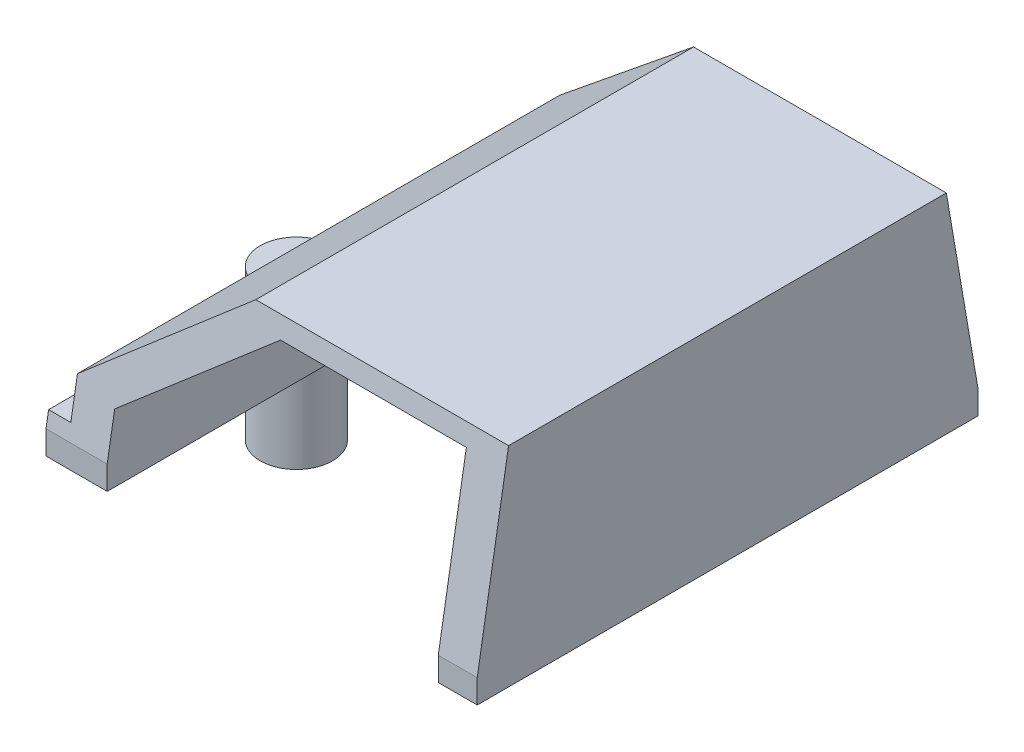
ISO-10303-21;
HEADER;
FILE_DESCRIPTION(('STEP AP214'),'2;1');
FILE_NAME('part.step','',(''),(''),'','','');
FILE_SCHEMA(('AUTOMOTIVE_DESIGN { 1 0 10303 214 1 1 1 1 }'));
ENDSEC;
DATA;
#1=APPLICATION_CONTEXT('core data for automotive mechanical design processes');
#2=APPLICATION_PROTOCOL_DEFINITION('international standard','automotive_design',2000,#1);
#3=PRODUCT_CONTEXT('',#1,'mechanical');
#4=PRODUCT('Part','Part','',(#3));
#5=PRODUCT_RELATED_PRODUCT_CATEGORY('part','',(#4));
#6=PRODUCT_DEFINITION_FORMATION('','',#4);
#7=PRODUCT_DEFINITION_CONTEXT('part definition',#1,'design');
#8=PRODUCT_DEFINITION('design','',#6,#7);
#9=PRODUCT_DEFINITION_SHAPE('','',#8);
#10=(LENGTH_UNIT() NAMED_UNIT(*) SI_UNIT(.MILLI.,.METRE.));
#11=(NAMED_UNIT(*) PLANE_ANGLE_UNIT() SI_UNIT($,.RADIAN.));
#12=(NAMED_UNIT(*) SI_UNIT($,.STERADIAN.) SOLID_ANGLE_UNIT());
#13=UNCERTAINTY_MEASURE_WITH_UNIT(LENGTH_MEASURE(1.E-05),#10,'distance_accuracy_value','');
#14=(GEOMETRIC_REPRESENTATION_CONTEXT(3) GLOBAL_UNCERTAINTY_ASSIGNED_CONTEXT((#13)) GLOBAL_UNIT_ASSIGNED_CONTEXT((#10,
#11,#12)) REPRESENTATION_CONTEXT('',''));
#15=CARTESIAN_POINT('',(0.,0.,0.));
#16=DIRECTION('',(0.,0.,1.));
#17=DIRECTION('',(1.,0.,0.));
#18=AXIS2_PLACEMENT_3D('',#15,#16,#17);
#19=CARTESIAN_POINT('',(-13.789144220563,-5.08,19.8204372004348));
#20=DIRECTION('',(0.,1.,0.));
#21=DIRECTION('',(0.,0.,1.));
#22=AXIS2_PLACEMENT_3D('',#19,#20,#21);
#23=CYLINDRICAL_SURFACE('',#22,1.651);
#24=CARTESIAN_POINT('',(-13.789144220563,-5.08,19.8204372004348));
#25=DIRECTION('',(0.,1.,0.));
#26=DIRECTION('',(0.,0.,1.));
#27=AXIS2_PLACEMENT_3D('',#24,#25,#26);
#28=CIRCLE('',#27,1.651);
#29=CARTESIAN_POINT('',(-13.789144220563,-5.08,21.4714372004348));
#30=VERTEX_POINT('',#29);
#31=EDGE_CURVE('E12',#30,#30,#28,.T.);
#32=ORIENTED_EDGE('',*,*,#31,.T.);
#33=EDGE_LOOP('',(#32));
#34=FACE_BOUND('',#33,.T.);
#35=CARTESIAN_POINT('',(-13.789144220563,0.,19.8204372004348));
#36=DIRECTION('',(0.,1.,0.));
#37=DIRECTION('',(0.,0.,1.));
#38=AXIS2_PLACEMENT_3D('',#35,#36,#37);
#39=CIRCLE('',#38,1.651);
#40=CARTESIAN_POINT('',(-13.789144220563,0.,21.4714372004348));
#41=VERTEX_POINT('',#40);
#42=EDGE_CURVE('E71',#41,#41,#39,.T.);
#43=ORIENTED_EDGE('',*,*,#42,.F.);
#44=EDGE_LOOP('',(#43));
#45=FACE_BOUND('',#44,.T.);
#46=ADVANCED_FACE('F68',(#34,#45),#23,.T.);
#47=CARTESIAN_POINT('',(-13.789144220563,-5.08,19.8204372004348));
#48=DIRECTION('',(0.,1.,0.));
#49=DIRECTION('',(0.,0.,1.));
#50=AXIS2_PLACEMENT_3D('',#47,#48,#49);
#51=PLANE('',#50);
#52=ORIENTED_EDGE('',*,*,#31,.F.);
#53=EDGE_LOOP('',(#52));
#54=FACE_BOUND('',#53,.T.);
#55=ADVANCED_FACE('F87',(#54),#51,.F.);
#56=CARTESIAN_POINT('',(-13.789144220563,0.,19.8204372004348));
#57=DIRECTION('',(0.,1.,0.));
#58=DIRECTION('',(0.,0.,1.));
#59=AXIS2_PLACEMENT_3D('',#56,#57,#58);
#60=PLANE('',#59);
#61=ORIENTED_EDGE('',*,*,#42,.T.);
#62=EDGE_LOOP('',(#61));
#63=FACE_BOUND('',#62,.T.);
#64=ADVANCED_FACE('F84',(#63),#60,.T.);
#65=CLOSED_SHELL('',(#46,#55,#64));
#66=MANIFOLD_SOLID_BREP('B2',#65);
#67=CARTESIAN_POINT('',(-15.440144220563,-1.36242874976471,7.97278696369274));
#68=DIRECTION('',(0.,0.168443169401586,-0.985711366821925));
#69=DIRECTION('',(0.,0.985711366821926,0.168443169401586));
#70=AXIS2_PLACEMENT_3D('',#67,#68,#69);
#71=PLANE('',#70);
#72=DIRECTION('',(0.,0.985711366821926,0.168443169401586));
#73=VECTOR('',#72,1.);
#74=CARTESIAN_POINT('',(4.11785577943697,-1.36242874976471,7.97278696369274));
#75=LINE('',#74,#73);
#76=CARTESIAN_POINT('',(4.11785577943697,1.08161565509339,8.39043720043479));
#77=VERTEX_POINT('',#76);
#78=CARTESIAN_POINT('',(4.11785577943696,8.65618487830787,9.6848165590939));
#79=VERTEX_POINT('',#78);
#80=EDGE_CURVE('E258',#77,#79,#75,.T.);
#81=ORIENTED_EDGE('',*,*,#80,.T.);
#82=DIRECTION('',(1.,0.,0.));
#83=VECTOR('',#82,1.);
#84=CARTESIAN_POINT('',(-15.440144220563,8.65618487830787,9.6848165590939));
#85=LINE('',#84,#83);
#86=CARTESIAN_POINT('',(-4.36387843382127,8.65618487830787,9.6848165590939));
#87=VERTEX_POINT('',#86);
#88=EDGE_CURVE('E265',#87,#79,#85,.T.);
#89=ORIENTED_EDGE('',*,*,#88,.F.);
#90=DIRECTION('',(-0.761411365987416,-0.639006148959604,-0.109196489581826));
#91=VECTOR('',#90,1.);
#92=CARTESIAN_POINT('',(-15.8021791542523,-0.943283714501808,8.04441251307263));
#93=LINE('',#92,#91);
#94=CARTESIAN_POINT('',(-10.995144220563,3.09096770083869,8.73380508521444));
#95=VERTEX_POINT('',#94);
#96=EDGE_CURVE('E248',#87,#95,#93,.T.);
#97=ORIENTED_EDGE('',*,*,#96,.T.);
#98=DIRECTION('',(0.,-0.985711366821926,-0.168443169401586));
#99=VECTOR('',#98,1.);
#100=CARTESIAN_POINT('',(-10.995144220563,-1.36242874976471,7.97278696369274));
#101=LINE('',#100,#99);
#102=CARTESIAN_POINT('',(-10.995144220563,1.08161565509339,8.39043720043479));
#103=VERTEX_POINT('',#102);
#104=EDGE_CURVE('E296',#95,#103,#101,.T.);
#105=ORIENTED_EDGE('',*,*,#104,.T.);
#106=DIRECTION('',(1.,0.,0.));
#107=VECTOR('',#106,1.);
#108=CARTESIAN_POINT('',(-15.440144220563,1.08161565509339,8.39043720043479));
#109=LINE('',#108,#107);
#110=CARTESIAN_POINT('',(-13.789144220563,1.08161565509339,8.39043720043479));
#111=VERTEX_POINT('',#110);
#112=EDGE_CURVE('E344',#111,#103,#109,.T.);
#113=ORIENTED_EDGE('',*,*,#112,.F.);
#114=DIRECTION('',(0.,0.985711366821926,0.168443169401586));
#115=VECTOR('',#114,1.);
#116=CARTESIAN_POINT('',(-13.789144220563,9.29873875908244,9.79461930240396));
#117=LINE('',#116,#115);
#118=CARTESIAN_POINT('',(-13.789144220563,1.778,8.50943875619032));
#119=VERTEX_POINT('',#118);
#120=EDGE_CURVE('E354',#111,#119,#117,.T.);
#121=ORIENTED_EDGE('',*,*,#120,.T.);
#122=DIRECTION('',(1.,0.,0.));
#123=VECTOR('',#122,1.);
#124=CARTESIAN_POINT('',(-12.773144220563,1.778,8.50943875619032));
#125=LINE('',#124,#123);
#126=CARTESIAN_POINT('',(-12.773144220563,1.778,8.50943875619032));
#127=VERTEX_POINT('',#126);
#128=EDGE_CURVE('E351',#119,#127,#125,.T.);
#129=ORIENTED_EDGE('',*,*,#128,.T.);
#130=DIRECTION('',(0.,0.985711366821926,0.168443169401586));
#131=VECTOR('',#130,1.);
#132=CARTESIAN_POINT('',(-12.773144220563,3.48579404228216,8.80127493750031));
#133=LINE('',#132,#131);
#134=CARTESIAN_POINT('',(-12.773144220563,3.556,8.81327207421487));
#135=VERTEX_POINT('',#134);
#136=EDGE_CURVE('E335',#127,#135,#133,.T.);
#137=ORIENTED_EDGE('',*,*,#136,.T.);
#138=DIRECTION('',(0.761411365987416,0.639006148959604,0.109196489581826));
#139=VECTOR('',#138,1.);
#140=CARTESIAN_POINT('',(-16.7822555291421,0.191397247159275,8.23831233392796));
#141=LINE('',#140,#139);
#142=CARTESIAN_POINT('',(-5.64443366605552,9.53869225016904,9.83562372612073));
#143=VERTEX_POINT('',#142);
#144=EDGE_CURVE('E309',#135,#143,#141,.T.);
#145=ORIENTED_EDGE('',*,*,#144,.T.);
#146=DIRECTION('',(1.,0.,0.));
#147=VECTOR('',#146,1.);
#148=CARTESIAN_POINT('',(-15.440144220563,9.53869225016905,9.83562372612074));
#149=LINE('',#148,#147);
#150=CARTESIAN_POINT('',(5.89585577943696,9.53869225016904,9.83562372612073));
#151=VERTEX_POINT('',#150);
#152=EDGE_CURVE('E341',#143,#151,#149,.T.);
#153=ORIENTED_EDGE('',*,*,#152,.T.);
#154=DIRECTION('',(0.,0.985711366821926,0.168443169401586));
#155=VECTOR('',#154,1.);
#156=CARTESIAN_POINT('',(5.89585577943696,-1.36242874976471,7.97278696369274));
#157=LINE('',#156,#155);
#158=CARTESIAN_POINT('',(5.89585577943696,1.08161565509338,8.39043720043479));
#159=VERTEX_POINT('',#158);
#160=EDGE_CURVE('E326',#159,#151,#157,.T.);
#161=ORIENTED_EDGE('',*,*,#160,.F.);
#162=EDGE_CURVE('E332',#77,#159,#109,.T.);
#163=ORIENTED_EDGE('',*,*,#162,.F.);
#164=EDGE_LOOP('',(#81,#89,#97,#105,#113,#121,#129,#137,#145,#153,#161,#163));
#165=FACE_BOUND('',#164,.T.);
#166=ADVANCED_FACE('F118',(#165),#71,.T.);
#167=CARTESIAN_POINT('',(-15.440144220563,5.17458080190063,30.5573342384337));
#168=DIRECTION('',(0.,-0.16696305893427,-0.985963151923697));
#169=DIRECTION('',(0.,0.985963151923697,-0.16696305893427));
#170=AXIS2_PLACEMENT_3D('',#167,#168,#169);
#171=PLANE('',#170);
#172=DIRECTION('',(1.,0.,0.));
#173=VECTOR('',#172,1.);
#174=CARTESIAN_POINT('',(-15.440144220563,8.65618487830787,29.9677591965461));
#175=LINE('',#174,#173);
#176=CARTESIAN_POINT('',(-4.36387843382127,8.65618487830787,29.9677591965461));
#177=VERTEX_POINT('',#176);
#178=CARTESIAN_POINT('',(4.11785577943696,8.65618487830787,29.9677591965461));
#179=VERTEX_POINT('',#178);
#180=EDGE_CURVE('E66',#177,#179,#175,.T.);
#181=ORIENTED_EDGE('',*,*,#180,.T.);
#182=DIRECTION('',(0.,0.985963151923697,-0.16696305893427));
#183=VECTOR('',#182,1.);
#184=CARTESIAN_POINT('',(4.11785577943696,5.17458080190063,30.5573342384336));
#185=LINE('',#184,#183);
#186=CARTESIAN_POINT('',(4.11785577943697,1.08161565509336,31.2504372004348));
#187=VERTEX_POINT('',#186);
#188=EDGE_CURVE('E299',#187,#179,#185,.T.);
#189=ORIENTED_EDGE('',*,*,#188,.F.);
#190=DIRECTION('',(1.,0.,0.));
#191=VECTOR('',#190,1.);
#192=CARTESIAN_POINT('',(-15.440144220563,1.08161565509339,31.2504372004348));
#193=LINE('',#192,#191);
#194=CARTESIAN_POINT('',(5.89585577943696,1.08161565509336,31.2504372004348));
#195=VERTEX_POINT('',#194);
#196=EDGE_CURVE('E340',#187,#195,#193,.T.);
#197=ORIENTED_EDGE('',*,*,#196,.T.);
#198=DIRECTION('',(0.,0.985963151923697,-0.16696305893427));
#199=VECTOR('',#198,1.);
#200=CARTESIAN_POINT('',(5.89585577943696,5.17458080190063,30.5573342384336));
#201=LINE('',#200,#199);
#202=CARTESIAN_POINT('',(5.89585577943696,9.53869225016905,29.8183153455761));
#203=VERTEX_POINT('',#202);
#204=EDGE_CURVE('E418',#195,#203,#201,.T.);
#205=ORIENTED_EDGE('',*,*,#204,.T.);
#206=DIRECTION('',(1.,0.,0.));
#207=VECTOR('',#206,1.);
#208=CARTESIAN_POINT('',(-15.440144220563,9.53869225016905,29.8183153455761));
#209=LINE('',#208,#207);
#210=CARTESIAN_POINT('',(-5.64443366605552,9.53869225016904,29.8183153455761));
#211=VERTEX_POINT('',#210);
#212=EDGE_CURVE('E142',#211,#203,#209,.T.);
#213=ORIENTED_EDGE('',*,*,#212,.F.);
#214=DIRECTION('',(0.76149308322921,0.639074729259709,-0.108220952757319));
#215=VECTOR('',#214,1.);
#216=CARTESIAN_POINT('',(-13.5093904747535,2.93811339547571,30.9360577623858));
#217=LINE('',#216,#215);
#218=CARTESIAN_POINT('',(-12.773144220563,3.556,30.8314248079345));
#219=VERTEX_POINT('',#218);
#220=EDGE_CURVE('E306',#219,#211,#217,.T.);
#221=ORIENTED_EDGE('',*,*,#220,.F.);
#222=DIRECTION('',(0.,0.985963151923697,-0.16696305893427));
#223=VECTOR('',#222,1.);
#224=CARTESIAN_POINT('',(-12.773144220563,7.25022245038433,30.2058449579204));
#225=LINE('',#224,#223);
#226=CARTESIAN_POINT('',(-12.773144220563,1.778,31.1325114339468));
#227=VERTEX_POINT('',#226);
#228=EDGE_CURVE('E357',#227,#219,#225,.T.);
#229=ORIENTED_EDGE('',*,*,#228,.F.);
#230=DIRECTION('',(1.,0.,0.));
#231=VECTOR('',#230,1.);
#232=CARTESIAN_POINT('',(-12.773144220563,1.778,31.1325114339468));
#233=LINE('',#232,#231);
#234=CARTESIAN_POINT('',(-13.789144220563,1.778,31.1325114339468));
#235=VERTEX_POINT('',#234);
#236=EDGE_CURVE('E361',#235,#227,#233,.T.);
#237=ORIENTED_EDGE('',*,*,#236,.F.);
#238=DIRECTION('',(0.,0.985963151923697,-0.16696305893427));
#239=VECTOR('',#238,1.);
#240=CARTESIAN_POINT('',(-13.789144220563,13.0661372045714,29.2209776066757));
#241=LINE('',#240,#239);
#242=CARTESIAN_POINT('',(-13.789144220563,1.08161565509339,31.2504372004348));
#243=VERTEX_POINT('',#242);
#244=EDGE_CURVE('E365',#243,#235,#241,.T.);
#245=ORIENTED_EDGE('',*,*,#244,.F.);
#246=CARTESIAN_POINT('',(-10.995144220563,1.08161565509339,31.2504372004348));
#247=VERTEX_POINT('',#246);
#248=EDGE_CURVE('E336',#243,#247,#193,.T.);
#249=ORIENTED_EDGE('',*,*,#248,.T.);
#250=DIRECTION('',(0.,-0.985963151923697,0.16696305893427));
#251=VECTOR('',#250,1.);
#252=CARTESIAN_POINT('',(-10.995144220563,5.17458080190063,30.5573342384337));
#253=LINE('',#252,#251);
#254=CARTESIAN_POINT('',(-10.995144220563,3.09096770083869,30.9101734052018));
#255=VERTEX_POINT('',#254);
#256=EDGE_CURVE('E134',#255,#247,#253,.T.);
#257=ORIENTED_EDGE('',*,*,#256,.F.);
#258=DIRECTION('',(-0.76149308322921,-0.639074729259708,0.108220952757319));
#259=VECTOR('',#258,1.);
#260=CARTESIAN_POINT('',(-12.5296043254722,1.8031888651517,31.1282459500201));
#261=LINE('',#260,#259);
#262=EDGE_CURVE('E127',#177,#255,#261,.T.);
#263=ORIENTED_EDGE('',*,*,#262,.F.);
#264=EDGE_LOOP('',(#181,#189,#197,#205,#213,#221,#229,#237,#245,#249,#257,#263));
#265=FACE_BOUND('',#264,.T.);
#266=ADVANCED_FACE('F428',(#265),#171,.F.);
#267=CARTESIAN_POINT('',(-13.789144220563,9.53869225016904,8.39043720043479));
#268=DIRECTION('',(0.,0.,-1.));
#269=DIRECTION('',(-1.,0.,0.));
#270=AXIS2_PLACEMENT_3D('',#267,#268,#269);
#271=PLANE('',#270);
#272=DIRECTION('',(1.,0.,0.));
#273=VECTOR('',#272,1.);
#274=CARTESIAN_POINT('',(-13.789144220563,0.,8.39043720043479));
#275=LINE('',#274,#273);
#276=CARTESIAN_POINT('',(4.11785577943697,0.,8.39043720043479));
#277=VERTEX_POINT('',#276);
#278=CARTESIAN_POINT('',(5.89585577943696,0.,8.39043720043479));
#279=VERTEX_POINT('',#278);
#280=EDGE_CURVE('E382',#277,#279,#275,.T.);
#281=ORIENTED_EDGE('',*,*,#280,.F.);
#282=DIRECTION('',(0.,-1.,0.));
#283=VECTOR('',#282,1.);
#284=CARTESIAN_POINT('',(4.11785577943697,0.,8.39043720043479));
#285=LINE('',#284,#283);
#286=EDGE_CURVE('E282',#77,#277,#285,.T.);
#287=ORIENTED_EDGE('',*,*,#286,.F.);
#288=ORIENTED_EDGE('',*,*,#162,.T.);
#289=DIRECTION('',(0.,-1.,0.));
#290=VECTOR('',#289,1.);
#291=CARTESIAN_POINT('',(5.89585577943696,0.,8.39043720043479));
#292=LINE('',#291,#290);
#293=EDGE_CURVE('E314',#159,#279,#292,.T.);
#294=ORIENTED_EDGE('',*,*,#293,.T.);
#295=EDGE_LOOP('',(#281,#287,#288,#294));
#296=FACE_BOUND('',#295,.T.);
#297=ADVANCED_FACE('F120',(#296),#271,.T.);
#298=ORIENTED_EDGE('',*,*,#112,.T.);
#299=DIRECTION('',(0.,1.,0.));
#300=VECTOR('',#299,1.);
#301=CARTESIAN_POINT('',(-10.995144220563,0.,8.39043720043479));
#302=LINE('',#301,#300);
#303=CARTESIAN_POINT('',(-10.995144220563,0.,8.39043720043479));
#304=VERTEX_POINT('',#303);
#305=EDGE_CURVE('E276',#304,#103,#302,.T.);
#306=ORIENTED_EDGE('',*,*,#305,.F.);
#307=CARTESIAN_POINT('',(-13.789144220563,0.,8.39043720043479));
#308=VERTEX_POINT('',#307);
#309=EDGE_CURVE('E389',#308,#304,#275,.T.);
#310=ORIENTED_EDGE('',*,*,#309,.F.);
#311=DIRECTION('',(0.,-1.,0.));
#312=VECTOR('',#311,1.);
#313=CARTESIAN_POINT('',(-13.789144220563,9.53869225016904,8.39043720043479));
#314=LINE('',#313,#312);
#315=EDGE_CURVE('E388',#111,#308,#314,.T.);
#316=ORIENTED_EDGE('',*,*,#315,.F.);
#317=EDGE_LOOP('',(#298,#306,#310,#316));
#318=FACE_BOUND('',#317,.T.);
#319=ADVANCED_FACE('F448',(#318),#271,.T.);
#320=CARTESIAN_POINT('',(-13.789144220563,0.,19.8204372004348));
#321=DIRECTION('',(0.,1.,0.));
#322=DIRECTION('',(0.,0.,1.));
#323=AXIS2_PLACEMENT_3D('',#320,#321,#322);
#324=PLANE('',#323);
#325=DIRECTION('',(0.,0.,1.));
#326=VECTOR('',#325,1.);
#327=CARTESIAN_POINT('',(4.11785577943697,0.,8.39043720043479));
#328=LINE('',#327,#326);
#329=CARTESIAN_POINT('',(4.11785577943697,0.,31.2504372004348));
#330=VERTEX_POINT('',#329);
#331=EDGE_CURVE('E285',#277,#330,#328,.T.);
#332=ORIENTED_EDGE('',*,*,#331,.F.);
#333=ORIENTED_EDGE('',*,*,#280,.T.);
#334=DIRECTION('',(0.,0.,1.));
#335=VECTOR('',#334,1.);
#336=CARTESIAN_POINT('',(5.89585577943696,0.,8.39043720043479));
#337=LINE('',#336,#335);
#338=CARTESIAN_POINT('',(5.89585577943696,0.,31.2504372004348));
#339=VERTEX_POINT('',#338);
#340=EDGE_CURVE('E322',#279,#339,#337,.T.);
#341=ORIENTED_EDGE('',*,*,#340,.T.);
#342=DIRECTION('',(1.,0.,0.));
#343=VECTOR('',#342,1.);
#344=CARTESIAN_POINT('',(-13.789144220563,0.,31.2504372004348));
#345=LINE('',#344,#343);
#346=EDGE_CURVE('E393',#330,#339,#345,.T.);
#347=ORIENTED_EDGE('',*,*,#346,.F.);
#348=EDGE_LOOP('',(#332,#333,#341,#347));
#349=FACE_BOUND('',#348,.T.);
#350=ADVANCED_FACE('F558',(#349),#324,.F.);
#351=DIRECTION('',(0.,0.,1.));
#352=VECTOR('',#351,1.);
#353=CARTESIAN_POINT('',(-10.995144220563,0.,8.39043720043479));
#354=LINE('',#353,#352);
#355=CARTESIAN_POINT('',(-10.995144220563,0.,31.2504372004348));
#356=VERTEX_POINT('',#355);
#357=EDGE_CURVE('E288',#304,#356,#354,.T.);
#358=ORIENTED_EDGE('',*,*,#357,.T.);
#359=CARTESIAN_POINT('',(-13.789144220563,0.,31.2504372004348));
#360=VERTEX_POINT('',#359);
#361=EDGE_CURVE('E394',#360,#356,#345,.T.);
#362=ORIENTED_EDGE('',*,*,#361,.F.);
#363=DIRECTION('',(0.,0.,1.));
#364=VECTOR('',#363,1.);
#365=CARTESIAN_POINT('',(-13.789144220563,0.,8.39043720043479));
#366=LINE('',#365,#364);
#367=CARTESIAN_POINT('',(-13.789144220563,0.,21.4714372004348));
#368=VERTEX_POINT('',#367);
#369=EDGE_CURVE('E398',#368,#360,#366,.T.);
#370=ORIENTED_EDGE('',*,*,#369,.F.);
#371=CARTESIAN_POINT('',(-13.789144220563,0.,19.8204372004348));
#372=DIRECTION('',(0.,1.,0.));
#373=DIRECTION('',(0.,0.,1.));
#374=AXIS2_PLACEMENT_3D('',#371,#372,#373);
#375=CIRCLE('',#374,1.651);
#376=CARTESIAN_POINT('',(-13.789144220563,0.,18.1694372004348));
#377=VERTEX_POINT('',#376);
#378=EDGE_CURVE('E383',#377,#368,#375,.T.);
#379=ORIENTED_EDGE('',*,*,#378,.F.);
#380=EDGE_CURVE('E399',#308,#377,#366,.T.);
#381=ORIENTED_EDGE('',*,*,#380,.F.);
#382=ORIENTED_EDGE('',*,*,#309,.T.);
#383=EDGE_LOOP('',(#358,#362,#370,#379,#381,#382));
#384=FACE_BOUND('',#383,.T.);
#385=ADVANCED_FACE('F443',(#384),#324,.F.);
#386=CARTESIAN_POINT('',(-13.789144220563,9.53869225016904,31.2504372004348));
#387=DIRECTION('',(0.,0.,-1.));
#388=DIRECTION('',(-1.,0.,0.));
#389=AXIS2_PLACEMENT_3D('',#386,#387,#388);
#390=PLANE('',#389);
#391=DIRECTION('',(0.,1.,0.));
#392=VECTOR('',#391,1.);
#393=CARTESIAN_POINT('',(4.11785577943696,9.53869225016904,31.2504372004348));
#394=LINE('',#393,#392);
#395=EDGE_CURVE('E422',#330,#187,#394,.T.);
#396=ORIENTED_EDGE('',*,*,#395,.F.);
#397=ORIENTED_EDGE('',*,*,#346,.T.);
#398=DIRECTION('',(0.,-1.,0.));
#399=VECTOR('',#398,1.);
#400=CARTESIAN_POINT('',(5.89585577943696,0.,31.2504372004348));
#401=LINE('',#400,#399);
#402=EDGE_CURVE('E313',#195,#339,#401,.T.);
#403=ORIENTED_EDGE('',*,*,#402,.F.);
#404=ORIENTED_EDGE('',*,*,#196,.F.);
#405=EDGE_LOOP('',(#396,#397,#403,#404));
#406=FACE_BOUND('',#405,.T.);
#407=ADVANCED_FACE('F475',(#406),#390,.F.);
#408=DIRECTION('',(0.,1.,0.));
#409=VECTOR('',#408,1.);
#410=CARTESIAN_POINT('',(-10.995144220563,0.,31.2504372004348));
#411=LINE('',#410,#409);
#412=EDGE_CURVE('E272',#356,#247,#411,.T.);
#413=ORIENTED_EDGE('',*,*,#412,.T.);
#414=ORIENTED_EDGE('',*,*,#248,.F.);
#415=DIRECTION('',(0.,-1.,0.));
#416=VECTOR('',#415,1.);
#417=CARTESIAN_POINT('',(-13.789144220563,9.53869225016904,31.2504372004348));
#418=LINE('',#417,#416);
#419=EDGE_CURVE('E403',#243,#360,#418,.T.);
#420=ORIENTED_EDGE('',*,*,#419,.T.);
#421=ORIENTED_EDGE('',*,*,#361,.T.);
#422=EDGE_LOOP('',(#413,#414,#420,#421));
#423=FACE_BOUND('',#422,.T.);
#424=ADVANCED_FACE('F432',(#423),#390,.F.);
#425=CARTESIAN_POINT('',(-13.789144220563,9.53869225016904,19.8204372004348));
#426=DIRECTION('',(0.,1.,0.));
#427=DIRECTION('',(0.,0.,1.));
#428=AXIS2_PLACEMENT_3D('',#425,#426,#427);
#429=PLANE('',#428);
#430=ORIENTED_EDGE('',*,*,#152,.F.);
#431=DIRECTION('',(0.,0.,1.));
#432=VECTOR('',#431,1.);
#433=CARTESIAN_POINT('',(-5.64443366605552,9.53869225016904,8.39043720043479));
#434=LINE('',#433,#432);
#435=EDGE_CURVE('E257',#143,#211,#434,.T.);
#436=ORIENTED_EDGE('',*,*,#435,.T.);
#437=ORIENTED_EDGE('',*,*,#212,.T.);
#438=DIRECTION('',(0.,0.,1.));
#439=VECTOR('',#438,1.);
#440=CARTESIAN_POINT('',(5.89585577943696,9.53869225016904,8.39043720043479));
#441=LINE('',#440,#439);
#442=EDGE_CURVE('E318',#151,#203,#441,.T.);
#443=ORIENTED_EDGE('',*,*,#442,.F.);
#444=EDGE_LOOP('',(#430,#436,#437,#443));
#445=FACE_BOUND('',#444,.T.);
#446=ADVANCED_FACE('F529',(#445),#429,.T.);
#447=CARTESIAN_POINT('',(-13.789144220563,9.53869225016904,8.39043720043479));
#448=DIRECTION('',(1.,0.,0.));
#449=DIRECTION('',(0.,0.,-1.));
#450=AXIS2_PLACEMENT_3D('',#447,#448,#449);
#451=PLANE('',#450);
#452=ORIENTED_EDGE('',*,*,#120,.F.);
#453=ORIENTED_EDGE('',*,*,#315,.T.);
#454=ORIENTED_EDGE('',*,*,#380,.T.);
#455=DIRECTION('',(0.,-1.,0.));
#456=VECTOR('',#455,1.);
#457=CARTESIAN_POINT('',(-13.789144220563,9.53869225016904,18.1694372004348));
#458=LINE('',#457,#456);
#459=CARTESIAN_POINT('',(-13.789144220563,1.778,18.1694372004348));
#460=VERTEX_POINT('',#459);
#461=EDGE_CURVE('E387',#377,#460,#458,.F.);
#462=ORIENTED_EDGE('',*,*,#461,.T.);
#463=DIRECTION('',(0.,0.,-1.));
#464=VECTOR('',#463,1.);
#465=CARTESIAN_POINT('',(-13.789144220563,1.778,8.39043720043479));
#466=LINE('',#465,#464);
#467=EDGE_CURVE('E414',#460,#119,#466,.T.);
#468=ORIENTED_EDGE('',*,*,#467,.T.);
#469=EDGE_LOOP('',(#452,#453,#454,#462,#468));
#470=FACE_BOUND('',#469,.T.);
#471=ADVANCED_FACE('F453',(#470),#451,.F.);
#472=CARTESIAN_POINT('',(-12.773144220563,1.778,8.39043720043479));
#473=DIRECTION('',(0.,-1.,0.));
#474=DIRECTION('',(0.,0.,-1.));
#475=AXIS2_PLACEMENT_3D('',#472,#473,#474);
#476=PLANE('',#475);
#477=DIRECTION('',(0.,0.,-1.));
#478=VECTOR('',#477,1.);
#479=CARTESIAN_POINT('',(-13.789144220563,1.778,8.39043720043479));
#480=LINE('',#479,#478);
#481=CARTESIAN_POINT('',(-13.789144220563,1.778,21.4714372004348));
#482=VERTEX_POINT('',#481);
#483=EDGE_CURVE('E379',#235,#482,#480,.T.);
#484=ORIENTED_EDGE('',*,*,#483,.F.);
#485=ORIENTED_EDGE('',*,*,#236,.T.);
#486=DIRECTION('',(0.,0.,1.));
#487=VECTOR('',#486,1.);
#488=CARTESIAN_POINT('',(-12.773144220563,1.778,8.39043720043479));
#489=LINE('',#488,#487);
#490=EDGE_CURVE('E370',#127,#227,#489,.T.);
#491=ORIENTED_EDGE('',*,*,#490,.F.);
#492=ORIENTED_EDGE('',*,*,#128,.F.);
#493=ORIENTED_EDGE('',*,*,#467,.F.);
#494=CARTESIAN_POINT('',(-13.789144220563,1.778,19.8204372004348));
#495=DIRECTION('',(0.,-1.,0.));
#496=DIRECTION('',(0.,0.,-1.));
#497=AXIS2_PLACEMENT_3D('',#494,#495,#496);
#498=CIRCLE('',#497,1.651);
#499=EDGE_CURVE('E374',#482,#460,#498,.T.);
#500=ORIENTED_EDGE('',*,*,#499,.F.);
#501=EDGE_LOOP('',(#484,#485,#491,#492,#493,#500));
#502=FACE_BOUND('',#501,.T.);
#503=ADVANCED_FACE('F457',(#502),#476,.F.);
#504=CARTESIAN_POINT('',(-12.773144220563,3.556,8.39043720043479));
#505=DIRECTION('',(1.,0.,0.));
#506=DIRECTION('',(0.,0.,-1.));
#507=AXIS2_PLACEMENT_3D('',#504,#505,#506);
#508=PLANE('',#507);
#509=ORIENTED_EDGE('',*,*,#490,.T.);
#510=ORIENTED_EDGE('',*,*,#228,.T.);
#511=DIRECTION('',(0.,0.,1.));
#512=VECTOR('',#511,1.);
#513=CARTESIAN_POINT('',(-12.773144220563,3.556,8.39043720043479));
#514=LINE('',#513,#512);
#515=EDGE_CURVE('E369',#135,#219,#514,.T.);
#516=ORIENTED_EDGE('',*,*,#515,.F.);
#517=ORIENTED_EDGE('',*,*,#136,.F.);
#518=EDGE_LOOP('',(#509,#510,#516,#517));
#519=FACE_BOUND('',#518,.T.);
#520=ADVANCED_FACE('F462',(#519),#508,.F.);
#521=CARTESIAN_POINT('',(-13.789144220563,9.53869225016904,19.8204372004348));
#522=DIRECTION('',(0.,-1.,0.));
#523=DIRECTION('',(0.,0.,-1.));
#524=AXIS2_PLACEMENT_3D('',#521,#522,#523);
#525=CYLINDRICAL_SURFACE('',#524,1.651);
#526=DIRECTION('',(0.,-1.,0.));
#527=VECTOR('',#526,1.);
#528=CARTESIAN_POINT('',(-13.789144220563,9.53869225016904,21.4714372004348));
#529=LINE('',#528,#527);
#530=EDGE_CURVE('E411',#482,#368,#529,.T.);
#531=ORIENTED_EDGE('',*,*,#530,.F.);
#532=ORIENTED_EDGE('',*,*,#499,.T.);
#533=ORIENTED_EDGE('',*,*,#461,.F.);
#534=ORIENTED_EDGE('',*,*,#378,.T.);
#535=EDGE_LOOP('',(#531,#532,#533,#534));
#536=FACE_BOUND('',#535,.T.);
#537=ADVANCED_FACE('F549',(#536),#525,.T.);
#538=ORIENTED_EDGE('',*,*,#419,.F.);
#539=ORIENTED_EDGE('',*,*,#244,.T.);
#540=ORIENTED_EDGE('',*,*,#483,.T.);
#541=ORIENTED_EDGE('',*,*,#530,.T.);
#542=ORIENTED_EDGE('',*,*,#369,.T.);
#543=EDGE_LOOP('',(#538,#539,#540,#541,#542));
#544=FACE_BOUND('',#543,.T.);
#545=ADVANCED_FACE('F435',(#544),#451,.F.);
#546=CARTESIAN_POINT('',(5.89585577943696,0.,8.39043720043479));
#547=DIRECTION('',(-1.,0.,0.));
#548=DIRECTION('',(0.,0.,1.));
#549=AXIS2_PLACEMENT_3D('',#546,#547,#548);
#550=PLANE('',#549);
#551=ORIENTED_EDGE('',*,*,#160,.T.);
#552=ORIENTED_EDGE('',*,*,#442,.T.);
#553=ORIENTED_EDGE('',*,*,#204,.F.);
#554=ORIENTED_EDGE('',*,*,#402,.T.);
#555=ORIENTED_EDGE('',*,*,#340,.F.);
#556=ORIENTED_EDGE('',*,*,#293,.F.);
#557=EDGE_LOOP('',(#551,#552,#553,#554,#555,#556));
#558=FACE_BOUND('',#557,.T.);
#559=ADVANCED_FACE('F471',(#558),#550,.F.);
#560=CARTESIAN_POINT('',(-5.64443366605552,9.53869225016904,8.39043720043479));
#561=DIRECTION('',(-0.642850275170762,0.765991856166158,0.));
#562=DIRECTION('',(-0.765991856166158,-0.642850275170762,0.));
#563=AXIS2_PLACEMENT_3D('',#560,#561,#562);
#564=PLANE('',#563);
#565=ORIENTED_EDGE('',*,*,#515,.T.);
#566=ORIENTED_EDGE('',*,*,#220,.T.);
#567=ORIENTED_EDGE('',*,*,#435,.F.);
#568=ORIENTED_EDGE('',*,*,#144,.F.);
#569=EDGE_LOOP('',(#565,#566,#567,#568));
#570=FACE_BOUND('',#569,.T.);
#571=ADVANCED_FACE('F465',(#570),#564,.T.);
#572=CARTESIAN_POINT('',(-6.06586292358455,7.22781303757206,8.39043720043479));
#573=DIRECTION('',(0.642850275170761,-0.765991856166159,0.));
#574=DIRECTION('',(0.765991856166159,0.642850275170761,0.));
#575=AXIS2_PLACEMENT_3D('',#572,#573,#574);
#576=PLANE('',#575);
#577=ORIENTED_EDGE('',*,*,#96,.F.);
#578=DIRECTION('',(0.,0.,1.));
#579=VECTOR('',#578,1.);
#580=CARTESIAN_POINT('',(-4.36387843382127,8.65618487830787,8.39043720043479));
#581=LINE('',#580,#579);
#582=EDGE_CURVE('E251',#87,#177,#581,.T.);
#583=ORIENTED_EDGE('',*,*,#582,.T.);
#584=ORIENTED_EDGE('',*,*,#262,.T.);
#585=DIRECTION('',(0.,0.,1.));
#586=VECTOR('',#585,1.);
#587=CARTESIAN_POINT('',(-10.995144220563,3.09096770083869,8.39043720043479));
#588=LINE('',#587,#586);
#589=EDGE_CURVE('E252',#95,#255,#588,.T.);
#590=ORIENTED_EDGE('',*,*,#589,.F.);
#591=EDGE_LOOP('',(#577,#583,#584,#590));
#592=FACE_BOUND('',#591,.T.);
#593=ADVANCED_FACE('F250',(#592),#576,.T.);
#594=CARTESIAN_POINT('',(4.11785577943697,0.,8.39043720043479));
#595=DIRECTION('',(-1.,0.,0.));
#596=DIRECTION('',(0.,0.,1.));
#597=AXIS2_PLACEMENT_3D('',#594,#595,#596);
#598=PLANE('',#597);
#599=ORIENTED_EDGE('',*,*,#286,.T.);
#600=ORIENTED_EDGE('',*,*,#331,.T.);
#601=ORIENTED_EDGE('',*,*,#395,.T.);
#602=ORIENTED_EDGE('',*,*,#188,.T.);
#603=DIRECTION('',(0.,0.,1.));
#604=VECTOR('',#603,1.);
#605=CARTESIAN_POINT('',(4.11785577943696,8.65618487830787,8.39043720043479));
#606=LINE('',#605,#604);
#607=EDGE_CURVE('E268',#79,#179,#606,.T.);
#608=ORIENTED_EDGE('',*,*,#607,.F.);
#609=ORIENTED_EDGE('',*,*,#80,.F.);
#610=EDGE_LOOP('',(#599,#600,#601,#602,#608,#609));
#611=FACE_BOUND('',#610,.T.);
#612=ADVANCED_FACE('F570',(#611),#598,.T.);
#613=CARTESIAN_POINT('',(-10.995144220563,0.,8.39043720043479));
#614=DIRECTION('',(1.,0.,0.));
#615=DIRECTION('',(0.,0.,-1.));
#616=AXIS2_PLACEMENT_3D('',#613,#614,#615);
#617=PLANE('',#616);
#618=ORIENTED_EDGE('',*,*,#589,.T.);
#619=ORIENTED_EDGE('',*,*,#256,.T.);
#620=ORIENTED_EDGE('',*,*,#412,.F.);
#621=ORIENTED_EDGE('',*,*,#357,.F.);
#622=ORIENTED_EDGE('',*,*,#305,.T.);
#623=ORIENTED_EDGE('',*,*,#104,.F.);
#624=EDGE_LOOP('',(#618,#619,#620,#621,#622,#623));
#625=FACE_BOUND('',#624,.T.);
#626=ADVANCED_FACE('F427',(#625),#617,.T.);
#627=CARTESIAN_POINT('',(0.,8.65618487830787,8.39043720043479));
#628=DIRECTION('',(0.,1.,0.));
#629=DIRECTION('',(-1.,0.,0.));
#630=AXIS2_PLACEMENT_3D('',#627,#628,#629);
#631=PLANE('',#630);
#632=ORIENTED_EDGE('',*,*,#88,.T.);
#633=ORIENTED_EDGE('',*,*,#607,.T.);
#634=ORIENTED_EDGE('',*,*,#180,.F.);
#635=ORIENTED_EDGE('',*,*,#582,.F.);
#636=EDGE_LOOP('',(#632,#633,#634,#635));
#637=FACE_BOUND('',#636,.T.);
#638=ADVANCED_FACE('F263',(#637),#631,.F.);
#639=CLOSED_SHELL('',(#166,#266,#297,#319,#350,#385,#407,#424,#446,#471,#503,#520,#537,#545,
#559,#571,#593,#612,#626,#638));
#640=MANIFOLD_SOLID_BREP('B7',#639);
#641=ADVANCED_BREP_SHAPE_REPRESENTATION('',(#18,#66,#640),#14);
#642=SHAPE_DEFINITION_REPRESENTATION(#9,#641);
ENDSEC;
END-ISO-10303-21;
